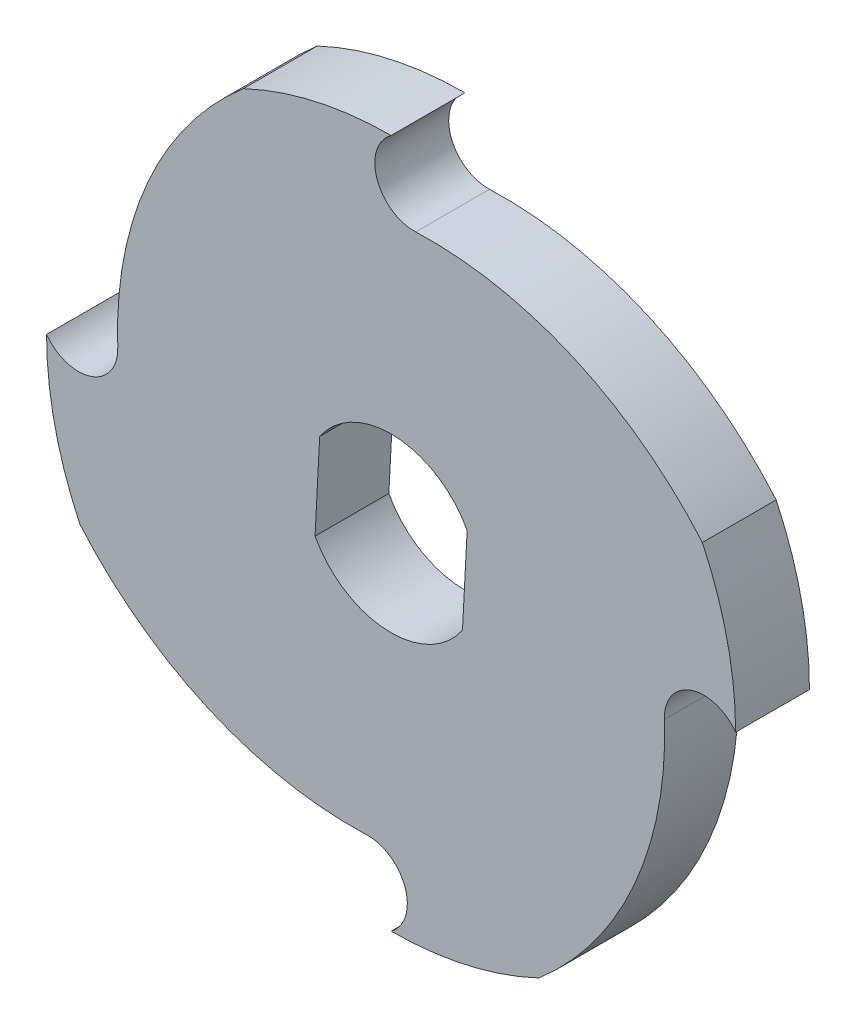
ISO-10303-21;
HEADER;
FILE_DESCRIPTION(('STEP AP214'),'2;1');
FILE_NAME('part.step','',(''),(''),'','','');
FILE_SCHEMA(('AUTOMOTIVE_DESIGN { 1 0 10303 214 1 1 1 1 }'));
ENDSEC;
DATA;
#1=APPLICATION_CONTEXT('core data for automotive mechanical design processes');
#2=APPLICATION_PROTOCOL_DEFINITION('international standard','automotive_design',2000,#1);
#3=PRODUCT_CONTEXT('',#1,'mechanical');
#4=PRODUCT('Part','Part','',(#3));
#5=PRODUCT_RELATED_PRODUCT_CATEGORY('part','',(#4));
#6=PRODUCT_DEFINITION_FORMATION('','',#4);
#7=PRODUCT_DEFINITION_CONTEXT('part definition',#1,'design');
#8=PRODUCT_DEFINITION('design','',#6,#7);
#9=PRODUCT_DEFINITION_SHAPE('','',#8);
#10=(LENGTH_UNIT() NAMED_UNIT(*) SI_UNIT(.MILLI.,.METRE.));
#11=(NAMED_UNIT(*) PLANE_ANGLE_UNIT() SI_UNIT($,.RADIAN.));
#12=(NAMED_UNIT(*) SI_UNIT($,.STERADIAN.) SOLID_ANGLE_UNIT());
#13=UNCERTAINTY_MEASURE_WITH_UNIT(LENGTH_MEASURE(1.E-05),#10,'distance_accuracy_value','');
#14=(GEOMETRIC_REPRESENTATION_CONTEXT(3) GLOBAL_UNCERTAINTY_ASSIGNED_CONTEXT((#13)) GLOBAL_UNIT_ASSIGNED_CONTEXT((#10,
#11,#12)) REPRESENTATION_CONTEXT('',''));
#15=CARTESIAN_POINT('',(0.,0.,0.));
#16=DIRECTION('',(0.,0.,1.));
#17=DIRECTION('',(1.,0.,0.));
#18=AXIS2_PLACEMENT_3D('',#15,#16,#17);
#19=CARTESIAN_POINT('',(0.,0.,-15.));
#20=DIRECTION('',(0.,0.,1.));
#21=DIRECTION('',(1.,0.,0.));
#22=AXIS2_PLACEMENT_3D('',#19,#20,#21);
#23=CYLINDRICAL_SURFACE('',#22,70.);
#24=CARTESIAN_POINT('',(0.,0.,0.));
#25=DIRECTION('',(0.,0.,1.));
#26=DIRECTION('',(1.,0.,0.));
#27=AXIS2_PLACEMENT_3D('',#24,#25,#26);
#28=CIRCLE('',#27,70.);
#29=CARTESIAN_POINT('',(0.,70.,0.));
#30=VERTEX_POINT('',#29);
#31=CARTESIAN_POINT('',(-30.,63.2455532033676,0.));
#32=VERTEX_POINT('',#31);
#33=EDGE_CURVE('E184',#30,#32,#28,.T.);
#34=ORIENTED_EDGE('',*,*,#33,.F.);
#35=DIRECTION('',(0.,0.,1.));
#36=VECTOR('',#35,1.);
#37=CARTESIAN_POINT('',(0.,70.,-15.));
#38=LINE('',#37,#36);
#39=CARTESIAN_POINT('',(0.,70.,-15.));
#40=VERTEX_POINT('',#39);
#41=EDGE_CURVE('E11',#40,#30,#38,.T.);
#42=ORIENTED_EDGE('',*,*,#41,.F.);
#43=CARTESIAN_POINT('',(0.,0.,-15.));
#44=DIRECTION('',(0.,0.,1.));
#45=DIRECTION('',(1.,0.,0.));
#46=AXIS2_PLACEMENT_3D('',#43,#44,#45);
#47=CIRCLE('',#46,70.);
#48=CARTESIAN_POINT('',(-30.,63.2455532033676,-15.));
#49=VERTEX_POINT('',#48);
#50=EDGE_CURVE('E188',#40,#49,#47,.T.);
#51=ORIENTED_EDGE('',*,*,#50,.T.);
#52=DIRECTION('',(0.,0.,1.));
#53=VECTOR('',#52,1.);
#54=CARTESIAN_POINT('',(-30.,63.2455532033676,-15.));
#55=LINE('',#54,#53);
#56=EDGE_CURVE('E41',#49,#32,#55,.T.);
#57=ORIENTED_EDGE('',*,*,#56,.T.);
#58=EDGE_LOOP('',(#34,#42,#51,#57));
#59=FACE_BOUND('',#58,.T.);
#60=ADVANCED_FACE('F38',(#59),#23,.T.);
#61=CARTESIAN_POINT('',(4.69949111878015,63.525837256872,-15.));
#62=DIRECTION('',(0.,0.,1.));
#63=DIRECTION('',(1.,0.,0.));
#64=AXIS2_PLACEMENT_3D('',#61,#62,#63);
#65=CYLINDRICAL_SURFACE('',#64,8.);
#66=CARTESIAN_POINT('',(4.69949111878015,63.525837256872,0.));
#67=DIRECTION('',(0.,0.,-1.));
#68=DIRECTION('',(1.,0.,0.));
#69=AXIS2_PLACEMENT_3D('',#66,#67,#68);
#70=CIRCLE('',#69,8.);
#71=CARTESIAN_POINT('',(4.99999999999999,55.5314833484997,0.));
#72=VERTEX_POINT('',#71);
#73=EDGE_CURVE('E192',#72,#30,#70,.T.);
#74=ORIENTED_EDGE('',*,*,#73,.F.);
#75=DIRECTION('',(0.,0.,1.));
#76=VECTOR('',#75,1.);
#77=CARTESIAN_POINT('',(4.99999999999999,55.5314833484997,-15.));
#78=LINE('',#77,#76);
#79=CARTESIAN_POINT('',(4.99999999999999,55.5314833484997,-15.));
#80=VERTEX_POINT('',#79);
#81=EDGE_CURVE('E46',#80,#72,#78,.T.);
#82=ORIENTED_EDGE('',*,*,#81,.F.);
#83=CARTESIAN_POINT('',(4.69949111878015,63.525837256872,-15.));
#84=DIRECTION('',(0.,0.,-1.));
#85=DIRECTION('',(1.,0.,0.));
#86=AXIS2_PLACEMENT_3D('',#83,#84,#85);
#87=CIRCLE('',#86,8.);
#88=EDGE_CURVE('E222',#80,#40,#87,.T.);
#89=ORIENTED_EDGE('',*,*,#88,.T.);
#90=ORIENTED_EDGE('',*,*,#41,.T.);
#91=EDGE_LOOP('',(#74,#82,#89,#90));
#92=FACE_BOUND('',#91,.T.);
#93=ADVANCED_FACE('F289',(#92),#65,.F.);
#94=CARTESIAN_POINT('',(7.74214354113111,-17.4169960653978,-15.));
#95=DIRECTION('',(0.,0.,1.));
#96=DIRECTION('',(1.,0.,0.));
#97=AXIS2_PLACEMENT_3D('',#94,#95,#96);
#98=CYLINDRICAL_SURFACE('',#97,73.);
#99=CARTESIAN_POINT('',(7.74214354113111,-17.4169960653978,0.));
#100=DIRECTION('',(0.,0.,1.));
#101=DIRECTION('',(-1.,0.,0.));
#102=AXIS2_PLACEMENT_3D('',#99,#100,#101);
#103=CIRCLE('',#102,73.);
#104=CARTESIAN_POINT('',(63.2455532033676,30.,0.));
#105=VERTEX_POINT('',#104);
#106=EDGE_CURVE('E254',#105,#72,#103,.T.);
#107=ORIENTED_EDGE('',*,*,#106,.F.);
#108=DIRECTION('',(0.,0.,1.));
#109=VECTOR('',#108,1.);
#110=CARTESIAN_POINT('',(63.2455532033676,30.,-15.));
#111=LINE('',#110,#109);
#112=CARTESIAN_POINT('',(63.2455532033676,30.,-15.));
#113=VERTEX_POINT('',#112);
#114=EDGE_CURVE('E260',#113,#105,#111,.T.);
#115=ORIENTED_EDGE('',*,*,#114,.F.);
#116=CARTESIAN_POINT('',(7.74214354113111,-17.4169960653978,-15.));
#117=DIRECTION('',(0.,0.,1.));
#118=DIRECTION('',(-1.,0.,0.));
#119=AXIS2_PLACEMENT_3D('',#116,#117,#118);
#120=CIRCLE('',#119,73.);
#121=EDGE_CURVE('E219',#113,#80,#120,.T.);
#122=ORIENTED_EDGE('',*,*,#121,.T.);
#123=ORIENTED_EDGE('',*,*,#81,.T.);
#124=EDGE_LOOP('',(#107,#115,#122,#123));
#125=FACE_BOUND('',#124,.T.);
#126=ADVANCED_FACE('F324',(#125),#98,.T.);
#127=CARTESIAN_POINT('',(0.,0.,-15.));
#128=DIRECTION('',(0.,0.,1.));
#129=DIRECTION('',(1.,0.,0.));
#130=AXIS2_PLACEMENT_3D('',#127,#128,#129);
#131=CYLINDRICAL_SURFACE('',#130,70.);
#132=CARTESIAN_POINT('',(0.,0.,0.));
#133=DIRECTION('',(0.,0.,1.));
#134=DIRECTION('',(1.,0.,0.));
#135=AXIS2_PLACEMENT_3D('',#132,#133,#134);
#136=CIRCLE('',#135,70.);
#137=CARTESIAN_POINT('',(70.,0.,0.));
#138=VERTEX_POINT('',#137);
#139=EDGE_CURVE('E251',#138,#105,#136,.T.);
#140=ORIENTED_EDGE('',*,*,#139,.F.);
#141=DIRECTION('',(0.,0.,1.));
#142=VECTOR('',#141,1.);
#143=CARTESIAN_POINT('',(70.,0.,-15.));
#144=LINE('',#143,#142);
#145=CARTESIAN_POINT('',(70.,0.,-15.));
#146=VERTEX_POINT('',#145);
#147=EDGE_CURVE('E262',#146,#138,#144,.T.);
#148=ORIENTED_EDGE('',*,*,#147,.F.);
#149=CARTESIAN_POINT('',(0.,0.,-15.));
#150=DIRECTION('',(0.,0.,1.));
#151=DIRECTION('',(1.,0.,0.));
#152=AXIS2_PLACEMENT_3D('',#149,#150,#151);
#153=CIRCLE('',#152,70.);
#154=EDGE_CURVE('E216',#146,#113,#153,.T.);
#155=ORIENTED_EDGE('',*,*,#154,.T.);
#156=ORIENTED_EDGE('',*,*,#114,.T.);
#157=EDGE_LOOP('',(#140,#148,#155,#156));
#158=FACE_BOUND('',#157,.T.);
#159=ADVANCED_FACE('F321',(#158),#131,.T.);
#160=CARTESIAN_POINT('',(63.525837256872,-4.69949111878015,-15.));
#161=DIRECTION('',(0.,0.,1.));
#162=DIRECTION('',(1.,0.,0.));
#163=AXIS2_PLACEMENT_3D('',#160,#161,#162);
#164=CYLINDRICAL_SURFACE('',#163,8.00000000000001);
#165=CARTESIAN_POINT('',(63.525837256872,-4.69949111878015,0.));
#166=DIRECTION('',(0.,0.,-1.));
#167=DIRECTION('',(1.,0.,0.));
#168=AXIS2_PLACEMENT_3D('',#165,#166,#167);
#169=CIRCLE('',#168,8.00000000000001);
#170=CARTESIAN_POINT('',(55.5314833484997,-5.,0.));
#171=VERTEX_POINT('',#170);
#172=EDGE_CURVE('E248',#171,#138,#169,.T.);
#173=ORIENTED_EDGE('',*,*,#172,.F.);
#174=DIRECTION('',(0.,0.,1.));
#175=VECTOR('',#174,1.);
#176=CARTESIAN_POINT('',(55.5314833484997,-5.,-15.));
#177=LINE('',#176,#175);
#178=CARTESIAN_POINT('',(55.5314833484997,-5.,-15.));
#179=VERTEX_POINT('',#178);
#180=EDGE_CURVE('E264',#179,#171,#177,.T.);
#181=ORIENTED_EDGE('',*,*,#180,.F.);
#182=CARTESIAN_POINT('',(63.525837256872,-4.69949111878015,-15.));
#183=DIRECTION('',(0.,0.,-1.));
#184=DIRECTION('',(1.,0.,0.));
#185=AXIS2_PLACEMENT_3D('',#182,#183,#184);
#186=CIRCLE('',#185,8.00000000000001);
#187=EDGE_CURVE('E213',#179,#146,#186,.T.);
#188=ORIENTED_EDGE('',*,*,#187,.T.);
#189=ORIENTED_EDGE('',*,*,#147,.T.);
#190=EDGE_LOOP('',(#173,#181,#188,#189));
#191=FACE_BOUND('',#190,.T.);
#192=ADVANCED_FACE('F318',(#191),#164,.F.);
#193=CARTESIAN_POINT('',(-17.4169960653978,-7.74214354113112,-15.));
#194=DIRECTION('',(0.,0.,1.));
#195=DIRECTION('',(1.,0.,0.));
#196=AXIS2_PLACEMENT_3D('',#193,#194,#195);
#197=CYLINDRICAL_SURFACE('',#196,73.);
#198=CARTESIAN_POINT('',(-17.4169960653978,-7.74214354113112,0.));
#199=DIRECTION('',(0.,0.,1.));
#200=DIRECTION('',(-1.,0.,0.));
#201=AXIS2_PLACEMENT_3D('',#198,#199,#200);
#202=CIRCLE('',#201,73.);
#203=CARTESIAN_POINT('',(30.,-63.2455532033676,0.));
#204=VERTEX_POINT('',#203);
#205=EDGE_CURVE('E245',#204,#171,#202,.T.);
#206=ORIENTED_EDGE('',*,*,#205,.F.);
#207=DIRECTION('',(0.,0.,1.));
#208=VECTOR('',#207,1.);
#209=CARTESIAN_POINT('',(30.,-63.2455532033676,-15.));
#210=LINE('',#209,#208);
#211=CARTESIAN_POINT('',(30.,-63.2455532033676,-15.));
#212=VERTEX_POINT('',#211);
#213=EDGE_CURVE('E266',#212,#204,#210,.T.);
#214=ORIENTED_EDGE('',*,*,#213,.F.);
#215=CARTESIAN_POINT('',(-17.4169960653978,-7.74214354113112,-15.));
#216=DIRECTION('',(0.,0.,1.));
#217=DIRECTION('',(-1.,0.,0.));
#218=AXIS2_PLACEMENT_3D('',#215,#216,#217);
#219=CIRCLE('',#218,73.);
#220=EDGE_CURVE('E210',#212,#179,#219,.T.);
#221=ORIENTED_EDGE('',*,*,#220,.T.);
#222=ORIENTED_EDGE('',*,*,#180,.T.);
#223=EDGE_LOOP('',(#206,#214,#221,#222));
#224=FACE_BOUND('',#223,.T.);
#225=ADVANCED_FACE('F314',(#224),#197,.T.);
#226=CARTESIAN_POINT('',(0.,0.,-15.));
#227=DIRECTION('',(0.,0.,1.));
#228=DIRECTION('',(1.,0.,0.));
#229=AXIS2_PLACEMENT_3D('',#226,#227,#228);
#230=CYLINDRICAL_SURFACE('',#229,70.);
#231=CARTESIAN_POINT('',(0.,0.,0.));
#232=DIRECTION('',(0.,0.,1.));
#233=DIRECTION('',(1.,0.,0.));
#234=AXIS2_PLACEMENT_3D('',#231,#232,#233);
#235=CIRCLE('',#234,70.);
#236=CARTESIAN_POINT('',(0.,-70.,0.));
#237=VERTEX_POINT('',#236);
#238=EDGE_CURVE('E242',#237,#204,#235,.T.);
#239=ORIENTED_EDGE('',*,*,#238,.F.);
#240=DIRECTION('',(0.,0.,1.));
#241=VECTOR('',#240,1.);
#242=CARTESIAN_POINT('',(0.,-70.,-15.));
#243=LINE('',#242,#241);
#244=CARTESIAN_POINT('',(0.,-70.,-15.));
#245=VERTEX_POINT('',#244);
#246=EDGE_CURVE('E268',#245,#237,#243,.T.);
#247=ORIENTED_EDGE('',*,*,#246,.F.);
#248=CARTESIAN_POINT('',(0.,0.,-15.));
#249=DIRECTION('',(0.,0.,1.));
#250=DIRECTION('',(1.,0.,0.));
#251=AXIS2_PLACEMENT_3D('',#248,#249,#250);
#252=CIRCLE('',#251,70.);
#253=EDGE_CURVE('E207',#245,#212,#252,.T.);
#254=ORIENTED_EDGE('',*,*,#253,.T.);
#255=ORIENTED_EDGE('',*,*,#213,.T.);
#256=EDGE_LOOP('',(#239,#247,#254,#255));
#257=FACE_BOUND('',#256,.T.);
#258=ADVANCED_FACE('F310',(#257),#230,.T.);
#259=CARTESIAN_POINT('',(-4.69949111878013,-63.5258372568721,-15.));
#260=DIRECTION('',(0.,0.,1.));
#261=DIRECTION('',(1.,0.,0.));
#262=AXIS2_PLACEMENT_3D('',#259,#260,#261);
#263=CYLINDRICAL_SURFACE('',#262,8.);
#264=CARTESIAN_POINT('',(-4.69949111878013,-63.5258372568721,0.));
#265=DIRECTION('',(0.,0.,-1.));
#266=DIRECTION('',(1.,0.,0.));
#267=AXIS2_PLACEMENT_3D('',#264,#265,#266);
#268=CIRCLE('',#267,8.);
#269=CARTESIAN_POINT('',(-4.99999999999998,-55.5314833484997,0.));
#270=VERTEX_POINT('',#269);
#271=EDGE_CURVE('E239',#270,#237,#268,.T.);
#272=ORIENTED_EDGE('',*,*,#271,.F.);
#273=DIRECTION('',(0.,0.,1.));
#274=VECTOR('',#273,1.);
#275=CARTESIAN_POINT('',(-4.99999999999998,-55.5314833484997,-15.));
#276=LINE('',#275,#274);
#277=CARTESIAN_POINT('',(-4.99999999999998,-55.5314833484997,-15.));
#278=VERTEX_POINT('',#277);
#279=EDGE_CURVE('E270',#278,#270,#276,.T.);
#280=ORIENTED_EDGE('',*,*,#279,.F.);
#281=CARTESIAN_POINT('',(-4.69949111878013,-63.5258372568721,-15.));
#282=DIRECTION('',(0.,0.,-1.));
#283=DIRECTION('',(1.,0.,0.));
#284=AXIS2_PLACEMENT_3D('',#281,#282,#283);
#285=CIRCLE('',#284,8.);
#286=EDGE_CURVE('E204',#278,#245,#285,.T.);
#287=ORIENTED_EDGE('',*,*,#286,.T.);
#288=ORIENTED_EDGE('',*,*,#246,.T.);
#289=EDGE_LOOP('',(#272,#280,#287,#288));
#290=FACE_BOUND('',#289,.T.);
#291=ADVANCED_FACE('F306',(#290),#263,.F.);
#292=CARTESIAN_POINT('',(-7.7421435411311,17.4169960653978,-15.));
#293=DIRECTION('',(0.,0.,1.));
#294=DIRECTION('',(1.,0.,0.));
#295=AXIS2_PLACEMENT_3D('',#292,#293,#294);
#296=CYLINDRICAL_SURFACE('',#295,73.);
#297=CARTESIAN_POINT('',(-7.7421435411311,17.4169960653978,0.));
#298=DIRECTION('',(0.,0.,1.));
#299=DIRECTION('',(-1.,0.,0.));
#300=AXIS2_PLACEMENT_3D('',#297,#298,#299);
#301=CIRCLE('',#300,73.);
#302=CARTESIAN_POINT('',(-63.2455532033676,-30.,0.));
#303=VERTEX_POINT('',#302);
#304=EDGE_CURVE('E236',#303,#270,#301,.T.);
#305=ORIENTED_EDGE('',*,*,#304,.F.);
#306=DIRECTION('',(0.,0.,1.));
#307=VECTOR('',#306,1.);
#308=CARTESIAN_POINT('',(-63.2455532033676,-30.,-15.));
#309=LINE('',#308,#307);
#310=CARTESIAN_POINT('',(-63.2455532033676,-30.,-15.));
#311=VERTEX_POINT('',#310);
#312=EDGE_CURVE('E272',#311,#303,#309,.T.);
#313=ORIENTED_EDGE('',*,*,#312,.F.);
#314=CARTESIAN_POINT('',(-7.7421435411311,17.4169960653978,-15.));
#315=DIRECTION('',(0.,0.,1.));
#316=DIRECTION('',(-1.,0.,0.));
#317=AXIS2_PLACEMENT_3D('',#314,#315,#316);
#318=CIRCLE('',#317,73.);
#319=EDGE_CURVE('E201',#311,#278,#318,.T.);
#320=ORIENTED_EDGE('',*,*,#319,.T.);
#321=ORIENTED_EDGE('',*,*,#279,.T.);
#322=EDGE_LOOP('',(#305,#313,#320,#321));
#323=FACE_BOUND('',#322,.T.);
#324=ADVANCED_FACE('F302',(#323),#296,.T.);
#325=CARTESIAN_POINT('',(0.,0.,-15.));
#326=DIRECTION('',(0.,0.,1.));
#327=DIRECTION('',(1.,0.,0.));
#328=AXIS2_PLACEMENT_3D('',#325,#326,#327);
#329=CYLINDRICAL_SURFACE('',#328,70.);
#330=CARTESIAN_POINT('',(0.,0.,0.));
#331=DIRECTION('',(0.,0.,1.));
#332=DIRECTION('',(1.,0.,0.));
#333=AXIS2_PLACEMENT_3D('',#330,#331,#332);
#334=CIRCLE('',#333,70.);
#335=CARTESIAN_POINT('',(-70.,0.,0.));
#336=VERTEX_POINT('',#335);
#337=EDGE_CURVE('E233',#336,#303,#334,.T.);
#338=ORIENTED_EDGE('',*,*,#337,.F.);
#339=DIRECTION('',(0.,0.,1.));
#340=VECTOR('',#339,1.);
#341=CARTESIAN_POINT('',(-70.,0.,-15.));
#342=LINE('',#341,#340);
#343=CARTESIAN_POINT('',(-70.,0.,-15.));
#344=VERTEX_POINT('',#343);
#345=EDGE_CURVE('E274',#344,#336,#342,.T.);
#346=ORIENTED_EDGE('',*,*,#345,.F.);
#347=CARTESIAN_POINT('',(0.,0.,-15.));
#348=DIRECTION('',(0.,0.,1.));
#349=DIRECTION('',(1.,0.,0.));
#350=AXIS2_PLACEMENT_3D('',#347,#348,#349);
#351=CIRCLE('',#350,70.);
#352=EDGE_CURVE('E198',#344,#311,#351,.T.);
#353=ORIENTED_EDGE('',*,*,#352,.T.);
#354=ORIENTED_EDGE('',*,*,#312,.T.);
#355=EDGE_LOOP('',(#338,#346,#353,#354));
#356=FACE_BOUND('',#355,.T.);
#357=ADVANCED_FACE('F300',(#356),#329,.T.);
#358=CARTESIAN_POINT('',(-63.525837256872,4.69949111878012,-15.));
#359=DIRECTION('',(0.,0.,1.));
#360=DIRECTION('',(1.,0.,0.));
#361=AXIS2_PLACEMENT_3D('',#358,#359,#360);
#362=CYLINDRICAL_SURFACE('',#361,7.99999999999999);
#363=CARTESIAN_POINT('',(-63.525837256872,4.69949111878012,0.));
#364=DIRECTION('',(0.,0.,-1.));
#365=DIRECTION('',(1.,0.,0.));
#366=AXIS2_PLACEMENT_3D('',#363,#364,#365);
#367=CIRCLE('',#366,7.99999999999999);
#368=CARTESIAN_POINT('',(-55.5314833484997,4.99999999999997,0.));
#369=VERTEX_POINT('',#368);
#370=EDGE_CURVE('E230',#369,#336,#367,.T.);
#371=ORIENTED_EDGE('',*,*,#370,.F.);
#372=DIRECTION('',(0.,0.,1.));
#373=VECTOR('',#372,1.);
#374=CARTESIAN_POINT('',(-55.5314833484997,4.99999999999997,-15.));
#375=LINE('',#374,#373);
#376=CARTESIAN_POINT('',(-55.5314833484997,4.99999999999997,-15.));
#377=VERTEX_POINT('',#376);
#378=EDGE_CURVE('E275',#377,#369,#375,.T.);
#379=ORIENTED_EDGE('',*,*,#378,.F.);
#380=CARTESIAN_POINT('',(-63.525837256872,4.69949111878012,-15.));
#381=DIRECTION('',(0.,0.,-1.));
#382=DIRECTION('',(1.,0.,0.));
#383=AXIS2_PLACEMENT_3D('',#380,#381,#382);
#384=CIRCLE('',#383,7.99999999999999);
#385=EDGE_CURVE('E195',#377,#344,#384,.T.);
#386=ORIENTED_EDGE('',*,*,#385,.T.);
#387=ORIENTED_EDGE('',*,*,#345,.T.);
#388=EDGE_LOOP('',(#371,#379,#386,#387));
#389=FACE_BOUND('',#388,.T.);
#390=ADVANCED_FACE('F296',(#389),#362,.F.);
#391=CARTESIAN_POINT('',(17.4169960653978,7.74214354113109,-15.));
#392=DIRECTION('',(0.,0.,1.));
#393=DIRECTION('',(1.,0.,0.));
#394=AXIS2_PLACEMENT_3D('',#391,#392,#393);
#395=CYLINDRICAL_SURFACE('',#394,73.);
#396=CARTESIAN_POINT('',(17.4169960653978,7.74214354113109,0.));
#397=DIRECTION('',(0.,0.,1.));
#398=DIRECTION('',(-1.,0.,0.));
#399=AXIS2_PLACEMENT_3D('',#396,#397,#398);
#400=CIRCLE('',#399,73.);
#401=EDGE_CURVE('E227',#32,#369,#400,.T.);
#402=ORIENTED_EDGE('',*,*,#401,.F.);
#403=ORIENTED_EDGE('',*,*,#56,.F.);
#404=CARTESIAN_POINT('',(17.4169960653978,7.74214354113109,-15.));
#405=DIRECTION('',(0.,0.,1.));
#406=DIRECTION('',(-1.,0.,0.));
#407=AXIS2_PLACEMENT_3D('',#404,#405,#406);
#408=CIRCLE('',#407,73.);
#409=EDGE_CURVE('E191',#49,#377,#408,.T.);
#410=ORIENTED_EDGE('',*,*,#409,.T.);
#411=ORIENTED_EDGE('',*,*,#378,.T.);
#412=EDGE_LOOP('',(#402,#403,#410,#411));
#413=FACE_BOUND('',#412,.T.);
#414=ADVANCED_FACE('F283',(#413),#395,.T.);
#415=CARTESIAN_POINT('',(8.70849803269892,3.87107177056554,-15.));
#416=DIRECTION('',(0.,0.,1.));
#417=DIRECTION('',(1.,0.,0.));
#418=AXIS2_PLACEMENT_3D('',#415,#416,#417);
#419=PLANE('',#418);
#420=DIRECTION('',(-0.0523359562429439,-0.998629534754574,0.));
#421=VECTOR('',#420,1.);
#422=CARTESIAN_POINT('',(-15.4511929557795,-8.21648563823176,-15.));
#423=LINE('',#422,#421);
#424=CARTESIAN_POINT('',(-14.5076930868577,9.78656432552008,-15.));
#425=VERTEX_POINT('',#424);
#426=CARTESIAN_POINT('',(-15.4511929557795,-8.21648563823176,-15.));
#427=VERTEX_POINT('',#426);
#428=EDGE_CURVE('E159',#425,#427,#423,.T.);
#429=ORIENTED_EDGE('',*,*,#428,.T.);
#430=CARTESIAN_POINT('',(0.,0.,-15.));
#431=DIRECTION('',(0.,0.,1.));
#432=DIRECTION('',(1.,0.,0.));
#433=AXIS2_PLACEMENT_3D('',#430,#431,#432);
#434=CIRCLE('',#433,17.5);
#435=CARTESIAN_POINT('',(14.5076930868577,-9.78656432552008,-15.));
#436=VERTEX_POINT('',#435);
#437=EDGE_CURVE('E153',#427,#436,#434,.T.);
#438=ORIENTED_EDGE('',*,*,#437,.T.);
#439=DIRECTION('',(0.0523359562429439,0.998629534754574,0.));
#440=VECTOR('',#439,1.);
#441=CARTESIAN_POINT('',(14.5076930868577,-9.78656432552008,-15.));
#442=LINE('',#441,#440);
#443=CARTESIAN_POINT('',(15.4511929557795,8.21648563823176,-15.));
#444=VERTEX_POINT('',#443);
#445=EDGE_CURVE('E162',#436,#444,#442,.T.);
#446=ORIENTED_EDGE('',*,*,#445,.T.);
#447=CARTESIAN_POINT('',(0.,0.,-15.));
#448=DIRECTION('',(0.,0.,1.));
#449=DIRECTION('',(1.,0.,0.));
#450=AXIS2_PLACEMENT_3D('',#447,#448,#449);
#451=CIRCLE('',#450,17.5);
#452=EDGE_CURVE('E54',#444,#425,#451,.T.);
#453=ORIENTED_EDGE('',*,*,#452,.T.);
#454=EDGE_LOOP('',(#429,#438,#446,#453));
#455=FACE_BOUND('',#454,.T.);
#456=ORIENTED_EDGE('',*,*,#50,.F.);
#457=ORIENTED_EDGE('',*,*,#88,.F.);
#458=ORIENTED_EDGE('',*,*,#121,.F.);
#459=ORIENTED_EDGE('',*,*,#154,.F.);
#460=ORIENTED_EDGE('',*,*,#187,.F.);
#461=ORIENTED_EDGE('',*,*,#220,.F.);
#462=ORIENTED_EDGE('',*,*,#253,.F.);
#463=ORIENTED_EDGE('',*,*,#286,.F.);
#464=ORIENTED_EDGE('',*,*,#319,.F.);
#465=ORIENTED_EDGE('',*,*,#352,.F.);
#466=ORIENTED_EDGE('',*,*,#385,.F.);
#467=ORIENTED_EDGE('',*,*,#409,.F.);
#468=EDGE_LOOP('',(#456,#457,#458,#459,#460,#461,#462,#463,#464,#465,#466,#467));
#469=FACE_BOUND('',#468,.T.);
#470=ADVANCED_FACE('F166',(#455,#469),#419,.F.);
#471=CARTESIAN_POINT('',(8.70849803269892,3.87107177056554,0.));
#472=DIRECTION('',(0.,0.,1.));
#473=DIRECTION('',(1.,0.,0.));
#474=AXIS2_PLACEMENT_3D('',#471,#472,#473);
#475=PLANE('',#474);
#476=CARTESIAN_POINT('',(0.,0.,0.));
#477=DIRECTION('',(0.,0.,1.));
#478=DIRECTION('',(1.,0.,0.));
#479=AXIS2_PLACEMENT_3D('',#476,#477,#478);
#480=CIRCLE('',#479,17.5);
#481=CARTESIAN_POINT('',(-15.4511929557795,-8.21648563823176,0.));
#482=VERTEX_POINT('',#481);
#483=CARTESIAN_POINT('',(14.5076930868577,-9.78656432552007,0.));
#484=VERTEX_POINT('',#483);
#485=EDGE_CURVE('E62',#482,#484,#480,.T.);
#486=ORIENTED_EDGE('',*,*,#485,.F.);
#487=DIRECTION('',(-0.0523359562429439,-0.998629534754574,0.));
#488=VECTOR('',#487,1.);
#489=CARTESIAN_POINT('',(-15.4511929557795,-8.21648563823176,0.));
#490=LINE('',#489,#488);
#491=CARTESIAN_POINT('',(-14.5076930868577,9.78656432552008,0.));
#492=VERTEX_POINT('',#491);
#493=EDGE_CURVE('E169',#492,#482,#490,.T.);
#494=ORIENTED_EDGE('',*,*,#493,.F.);
#495=CARTESIAN_POINT('',(0.,0.,0.));
#496=DIRECTION('',(0.,0.,1.));
#497=DIRECTION('',(1.,0.,0.));
#498=AXIS2_PLACEMENT_3D('',#495,#496,#497);
#499=CIRCLE('',#498,17.5);
#500=CARTESIAN_POINT('',(15.4511929557795,8.21648563823176,0.));
#501=VERTEX_POINT('',#500);
#502=EDGE_CURVE('E172',#501,#492,#499,.T.);
#503=ORIENTED_EDGE('',*,*,#502,.F.);
#504=DIRECTION('',(0.0523359562429439,0.998629534754574,0.));
#505=VECTOR('',#504,1.);
#506=CARTESIAN_POINT('',(14.5076930868577,-9.78656432552008,0.));
#507=LINE('',#506,#505);
#508=EDGE_CURVE('E178',#484,#501,#507,.T.);
#509=ORIENTED_EDGE('',*,*,#508,.F.);
#510=EDGE_LOOP('',(#486,#494,#503,#509));
#511=FACE_BOUND('',#510,.T.);
#512=ORIENTED_EDGE('',*,*,#33,.T.);
#513=ORIENTED_EDGE('',*,*,#401,.T.);
#514=ORIENTED_EDGE('',*,*,#370,.T.);
#515=ORIENTED_EDGE('',*,*,#337,.T.);
#516=ORIENTED_EDGE('',*,*,#304,.T.);
#517=ORIENTED_EDGE('',*,*,#271,.T.);
#518=ORIENTED_EDGE('',*,*,#238,.T.);
#519=ORIENTED_EDGE('',*,*,#205,.T.);
#520=ORIENTED_EDGE('',*,*,#172,.T.);
#521=ORIENTED_EDGE('',*,*,#139,.T.);
#522=ORIENTED_EDGE('',*,*,#106,.T.);
#523=ORIENTED_EDGE('',*,*,#73,.T.);
#524=EDGE_LOOP('',(#512,#513,#514,#515,#516,#517,#518,#519,#520,#521,#522,#523));
#525=FACE_BOUND('',#524,.T.);
#526=ADVANCED_FACE('F285',(#511,#525),#475,.T.);
#527=CARTESIAN_POINT('',(0.,0.,-15.));
#528=DIRECTION('',(0.,0.,1.));
#529=DIRECTION('',(1.,0.,0.));
#530=AXIS2_PLACEMENT_3D('',#527,#528,#529);
#531=CYLINDRICAL_SURFACE('',#530,17.5);
#532=ORIENTED_EDGE('',*,*,#485,.T.);
#533=DIRECTION('',(0.,0.,1.));
#534=VECTOR('',#533,1.);
#535=CARTESIAN_POINT('',(14.5076930868577,-9.78656432552008,-15.));
#536=LINE('',#535,#534);
#537=EDGE_CURVE('E149',#436,#484,#536,.T.);
#538=ORIENTED_EDGE('',*,*,#537,.F.);
#539=ORIENTED_EDGE('',*,*,#437,.F.);
#540=DIRECTION('',(0.,0.,1.));
#541=VECTOR('',#540,1.);
#542=CARTESIAN_POINT('',(-15.4511929557795,-8.21648563823176,-15.));
#543=LINE('',#542,#541);
#544=EDGE_CURVE('E182',#427,#482,#543,.T.);
#545=ORIENTED_EDGE('',*,*,#544,.T.);
#546=EDGE_LOOP('',(#532,#538,#539,#545));
#547=FACE_BOUND('',#546,.T.);
#548=ADVANCED_FACE('F151',(#547),#531,.F.);
#549=CARTESIAN_POINT('',(-15.4511929557795,-8.21648563823176,-15.));
#550=DIRECTION('',(-0.998629534754574,0.0523359562429439,0.));
#551=DIRECTION('',(-0.0523359562429439,-0.998629534754574,0.));
#552=AXIS2_PLACEMENT_3D('',#549,#550,#551);
#553=PLANE('',#552);
#554=ORIENTED_EDGE('',*,*,#493,.T.);
#555=ORIENTED_EDGE('',*,*,#544,.F.);
#556=ORIENTED_EDGE('',*,*,#428,.F.);
#557=DIRECTION('',(0.,0.,1.));
#558=VECTOR('',#557,1.);
#559=CARTESIAN_POINT('',(-14.5076930868577,9.78656432552008,-15.));
#560=LINE('',#559,#558);
#561=EDGE_CURVE('E185',#425,#492,#560,.T.);
#562=ORIENTED_EDGE('',*,*,#561,.T.);
#563=EDGE_LOOP('',(#554,#555,#556,#562));
#564=FACE_BOUND('',#563,.T.);
#565=ADVANCED_FACE('F452',(#564),#553,.F.);
#566=CARTESIAN_POINT('',(0.,0.,-15.));
#567=DIRECTION('',(0.,0.,1.));
#568=DIRECTION('',(1.,0.,0.));
#569=AXIS2_PLACEMENT_3D('',#566,#567,#568);
#570=CYLINDRICAL_SURFACE('',#569,17.5);
#571=ORIENTED_EDGE('',*,*,#502,.T.);
#572=ORIENTED_EDGE('',*,*,#561,.F.);
#573=ORIENTED_EDGE('',*,*,#452,.F.);
#574=DIRECTION('',(0.,0.,1.));
#575=VECTOR('',#574,1.);
#576=CARTESIAN_POINT('',(15.4511929557795,8.21648563823176,-15.));
#577=LINE('',#576,#575);
#578=EDGE_CURVE('E158',#444,#501,#577,.T.);
#579=ORIENTED_EDGE('',*,*,#578,.T.);
#580=EDGE_LOOP('',(#571,#572,#573,#579));
#581=FACE_BOUND('',#580,.T.);
#582=ADVANCED_FACE('F462',(#581),#570,.F.);
#583=CARTESIAN_POINT('',(14.5076930868577,-9.78656432552008,-15.));
#584=DIRECTION('',(0.998629534754574,-0.0523359562429439,0.));
#585=DIRECTION('',(0.0523359562429439,0.998629534754574,0.));
#586=AXIS2_PLACEMENT_3D('',#583,#584,#585);
#587=PLANE('',#586);
#588=ORIENTED_EDGE('',*,*,#508,.T.);
#589=ORIENTED_EDGE('',*,*,#578,.F.);
#590=ORIENTED_EDGE('',*,*,#445,.F.);
#591=ORIENTED_EDGE('',*,*,#537,.T.);
#592=EDGE_LOOP('',(#588,#589,#590,#591));
#593=FACE_BOUND('',#592,.T.);
#594=ADVANCED_FACE('F163',(#593),#587,.F.);
#595=CLOSED_SHELL('',(#60,#93,#126,#159,#192,#225,#258,#291,#324,#357,#390,#414,#470,#526,#548,
#565,#582,#594));
#596=MANIFOLD_SOLID_BREP('B2',#595);
#597=ADVANCED_BREP_SHAPE_REPRESENTATION('',(#18,#596),#14);
#598=SHAPE_DEFINITION_REPRESENTATION(#9,#597);
ENDSEC;
END-ISO-10303-21;
